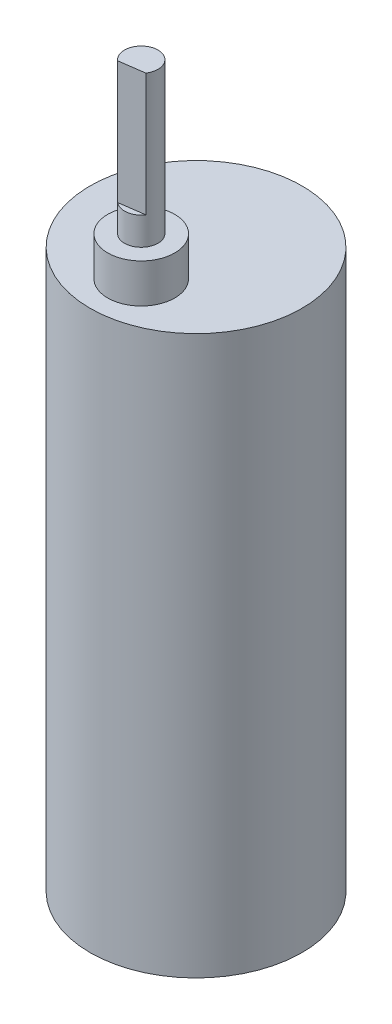
ISO-10303-21;
HEADER;
FILE_DESCRIPTION(('STEP AP214'),'2;1');
FILE_NAME('part.step','',(''),(''),'','','');
FILE_SCHEMA(('AUTOMOTIVE_DESIGN { 1 0 10303 214 1 1 1 1 }'));
ENDSEC;
DATA;
#1=APPLICATION_CONTEXT('core data for automotive mechanical design processes');
#2=APPLICATION_PROTOCOL_DEFINITION('international standard','automotive_design',2000,#1);
#3=PRODUCT_CONTEXT('',#1,'mechanical');
#4=PRODUCT('Part','Part','',(#3));
#5=PRODUCT_RELATED_PRODUCT_CATEGORY('part','',(#4));
#6=PRODUCT_DEFINITION_FORMATION('','',#4);
#7=PRODUCT_DEFINITION_CONTEXT('part definition',#1,'design');
#8=PRODUCT_DEFINITION('design','',#6,#7);
#9=PRODUCT_DEFINITION_SHAPE('','',#8);
#10=(LENGTH_UNIT() NAMED_UNIT(*) SI_UNIT(.MILLI.,.METRE.));
#11=(NAMED_UNIT(*) PLANE_ANGLE_UNIT() SI_UNIT($,.RADIAN.));
#12=(NAMED_UNIT(*) SI_UNIT($,.STERADIAN.) SOLID_ANGLE_UNIT());
#13=UNCERTAINTY_MEASURE_WITH_UNIT(LENGTH_MEASURE(1.E-05),#10,'distance_accuracy_value','');
#14=(GEOMETRIC_REPRESENTATION_CONTEXT(3) GLOBAL_UNCERTAINTY_ASSIGNED_CONTEXT((#13)) GLOBAL_UNIT_ASSIGNED_CONTEXT((#10,
#11,#12)) REPRESENTATION_CONTEXT('',''));
#15=CARTESIAN_POINT('',(0.,0.,0.));
#16=DIRECTION('',(0.,0.,1.));
#17=DIRECTION('',(1.,0.,0.));
#18=AXIS2_PLACEMENT_3D('',#15,#16,#17);
#19=CARTESIAN_POINT('',(0.,100.,0.));
#20=DIRECTION('',(0.,-1.,0.));
#21=DIRECTION('',(0.,0.,-1.));
#22=AXIS2_PLACEMENT_3D('',#19,#20,#21);
#23=CYLINDRICAL_SURFACE('',#22,19.);
#24=CARTESIAN_POINT('',(0.,100.,0.));
#25=DIRECTION('',(0.,1.,0.));
#26=DIRECTION('',(0.,0.,1.));
#27=AXIS2_PLACEMENT_3D('',#24,#25,#26);
#28=CIRCLE('',#27,19.);
#29=CARTESIAN_POINT('',(0.,100.,19.));
#30=VERTEX_POINT('',#29);
#31=EDGE_CURVE('E92',#30,#30,#28,.T.);
#32=ORIENTED_EDGE('',*,*,#31,.F.);
#33=EDGE_LOOP('',(#32));
#34=FACE_BOUND('',#33,.T.);
#35=CARTESIAN_POINT('',(0.,0.,0.));
#36=DIRECTION('',(0.,1.,0.));
#37=DIRECTION('',(0.,0.,1.));
#38=AXIS2_PLACEMENT_3D('',#35,#36,#37);
#39=CIRCLE('',#38,19.);
#40=CARTESIAN_POINT('',(0.,0.,19.));
#41=VERTEX_POINT('',#40);
#42=EDGE_CURVE('E95',#41,#41,#39,.T.);
#43=ORIENTED_EDGE('',*,*,#42,.T.);
#44=EDGE_LOOP('',(#43));
#45=FACE_BOUND('',#44,.T.);
#46=ADVANCED_FACE('F39',(#34,#45),#23,.T.);
#47=CARTESIAN_POINT('',(0.,100.,0.));
#48=DIRECTION('',(0.,1.,0.));
#49=DIRECTION('',(0.,0.,1.));
#50=AXIS2_PLACEMENT_3D('',#47,#48,#49);
#51=PLANE('',#50);
#52=CARTESIAN_POINT('',(0.,100.,9.825));
#53=DIRECTION('',(0.,1.,0.));
#54=DIRECTION('',(0.,0.,1.));
#55=AXIS2_PLACEMENT_3D('',#52,#53,#54);
#56=CIRCLE('',#55,6.);
#57=CARTESIAN_POINT('',(0.,100.,15.825));
#58=VERTEX_POINT('',#57);
#59=EDGE_CURVE('E80',#58,#58,#56,.T.);
#60=ORIENTED_EDGE('',*,*,#59,.F.);
#61=EDGE_LOOP('',(#60));
#62=FACE_BOUND('',#61,.T.);
#63=ORIENTED_EDGE('',*,*,#31,.T.);
#64=EDGE_LOOP('',(#63));
#65=FACE_BOUND('',#64,.T.);
#66=ADVANCED_FACE('F108',(#62,#65),#51,.T.);
#67=CARTESIAN_POINT('',(0.,0.,0.));
#68=DIRECTION('',(0.,1.,0.));
#69=DIRECTION('',(0.,0.,1.));
#70=AXIS2_PLACEMENT_3D('',#67,#68,#69);
#71=PLANE('',#70);
#72=ORIENTED_EDGE('',*,*,#42,.F.);
#73=EDGE_LOOP('',(#72));
#74=FACE_BOUND('',#73,.T.);
#75=ADVANCED_FACE('F105',(#74),#71,.F.);
#76=CARTESIAN_POINT('',(0.,107.,9.825));
#77=DIRECTION('',(0.,-1.,0.));
#78=DIRECTION('',(0.,0.,-1.));
#79=AXIS2_PLACEMENT_3D('',#76,#77,#78);
#80=CYLINDRICAL_SURFACE('',#79,6.);
#81=CARTESIAN_POINT('',(0.,107.,9.825));
#82=DIRECTION('',(0.,1.,0.));
#83=DIRECTION('',(0.,0.,1.));
#84=AXIS2_PLACEMENT_3D('',#81,#82,#83);
#85=CIRCLE('',#84,6.);
#86=CARTESIAN_POINT('',(0.,107.,15.825));
#87=VERTEX_POINT('',#86);
#88=EDGE_CURVE('E85',#87,#87,#85,.T.);
#89=ORIENTED_EDGE('',*,*,#88,.F.);
#90=EDGE_LOOP('',(#89));
#91=FACE_BOUND('',#90,.T.);
#92=ORIENTED_EDGE('',*,*,#59,.T.);
#93=EDGE_LOOP('',(#92));
#94=FACE_BOUND('',#93,.T.);
#95=ADVANCED_FACE('F107',(#91,#94),#80,.T.);
#96=CARTESIAN_POINT('',(0.,107.,9.825));
#97=DIRECTION('',(0.,1.,0.));
#98=DIRECTION('',(0.,0.,1.));
#99=AXIS2_PLACEMENT_3D('',#96,#97,#98);
#100=PLANE('',#99);
#101=CARTESIAN_POINT('',(0.,107.,9.825));
#102=DIRECTION('',(0.,1.,0.));
#103=DIRECTION('',(0.,0.,1.));
#104=AXIS2_PLACEMENT_3D('',#101,#102,#103);
#105=CIRCLE('',#104,3.);
#106=CARTESIAN_POINT('',(0.,107.,12.825));
#107=VERTEX_POINT('',#106);
#108=EDGE_CURVE('E69',#107,#107,#105,.T.);
#109=ORIENTED_EDGE('',*,*,#108,.F.);
#110=EDGE_LOOP('',(#109));
#111=FACE_BOUND('',#110,.T.);
#112=ORIENTED_EDGE('',*,*,#88,.T.);
#113=EDGE_LOOP('',(#112));
#114=FACE_BOUND('',#113,.T.);
#115=ADVANCED_FACE('F113',(#111,#114),#100,.T.);
#116=CARTESIAN_POINT('',(0.,134.,9.825));
#117=DIRECTION('',(0.,-1.,0.));
#118=DIRECTION('',(0.,0.,-1.));
#119=AXIS2_PLACEMENT_3D('',#116,#117,#118);
#120=CYLINDRICAL_SURFACE('',#119,3.);
#121=CARTESIAN_POINT('',(0.,134.,9.825));
#122=DIRECTION('',(0.,1.,0.));
#123=DIRECTION('',(0.,0.,1.));
#124=AXIS2_PLACEMENT_3D('',#121,#122,#123);
#125=CIRCLE('',#124,3.);
#126=CARTESIAN_POINT('',(2.49341293350245,134.,11.4932002107189));
#127=VERTEX_POINT('',#126);
#128=CARTESIAN_POINT('',(-1.93491657983228,134.,12.1176181167151));
#129=VERTEX_POINT('',#128);
#130=EDGE_CURVE('E74',#127,#129,#125,.T.);
#131=ORIENTED_EDGE('',*,*,#130,.F.);
#132=DIRECTION('',(0.,-1.,0.));
#133=VECTOR('',#132,1.);
#134=CARTESIAN_POINT('',(2.49341293350245,134.,11.4932002107189));
#135=LINE('',#134,#133);
#136=CARTESIAN_POINT('',(2.49341293350245,112.,11.4932002107189));
#137=VERTEX_POINT('',#136);
#138=EDGE_CURVE('E54',#127,#137,#135,.T.);
#139=ORIENTED_EDGE('',*,*,#138,.T.);
#140=CARTESIAN_POINT('',(0.,112.,9.825));
#141=DIRECTION('',(0.,1.,0.));
#142=DIRECTION('',(0.,0.,1.));
#143=AXIS2_PLACEMENT_3D('',#140,#141,#142);
#144=CIRCLE('',#143,3.);
#145=CARTESIAN_POINT('',(-1.93491657983228,112.,12.1176181167151));
#146=VERTEX_POINT('',#145);
#147=EDGE_CURVE('E11',#146,#137,#144,.T.);
#148=ORIENTED_EDGE('',*,*,#147,.F.);
#149=DIRECTION('',(0.,-1.,0.));
#150=VECTOR('',#149,1.);
#151=CARTESIAN_POINT('',(-1.93491657983228,134.,12.1176181167151));
#152=LINE('',#151,#150);
#153=EDGE_CURVE('E59',#146,#129,#152,.F.);
#154=ORIENTED_EDGE('',*,*,#153,.T.);
#155=EDGE_LOOP('',(#131,#139,#148,#154));
#156=FACE_BOUND('',#155,.T.);
#157=ORIENTED_EDGE('',*,*,#108,.T.);
#158=EDGE_LOOP('',(#157));
#159=FACE_BOUND('',#158,.T.);
#160=ADVANCED_FACE('F72',(#156,#159),#120,.T.);
#161=CARTESIAN_POINT('',(0.,134.,9.825));
#162=DIRECTION('',(0.,1.,0.));
#163=DIRECTION('',(0.,0.,1.));
#164=AXIS2_PLACEMENT_3D('',#161,#162,#163);
#165=PLANE('',#164);
#166=DIRECTION('',(-0.990204581858502,0.,0.139624088417542));
#167=VECTOR('',#166,1.);
#168=CARTESIAN_POINT('',(0.279248176835084,134.,11.805409163717));
#169=LINE('',#168,#167);
#170=EDGE_CURVE('E47',#127,#129,#169,.T.);
#171=ORIENTED_EDGE('',*,*,#170,.F.);
#172=ORIENTED_EDGE('',*,*,#130,.T.);
#173=EDGE_LOOP('',(#171,#172));
#174=FACE_BOUND('',#173,.T.);
#175=ADVANCED_FACE('F78',(#174),#165,.T.);
#176=CARTESIAN_POINT('',(0.,112.,0.));
#177=DIRECTION('',(0.,1.,0.));
#178=DIRECTION('',(0.,0.,1.));
#179=AXIS2_PLACEMENT_3D('',#176,#177,#178);
#180=PLANE('',#179);
#181=ORIENTED_EDGE('',*,*,#147,.T.);
#182=DIRECTION('',(-0.990204581858502,0.,0.139624088417542));
#183=VECTOR('',#182,1.);
#184=CARTESIAN_POINT('',(-9.15063398495466,112.,13.1350724725391));
#185=LINE('',#184,#183);
#186=EDGE_CURVE('E76',#137,#146,#185,.T.);
#187=ORIENTED_EDGE('',*,*,#186,.T.);
#188=EDGE_LOOP('',(#181,#187));
#189=FACE_BOUND('',#188,.T.);
#190=ADVANCED_FACE('F162',(#189),#180,.T.);
#191=CARTESIAN_POINT('',(-9.15063398495466,112.,13.1350724725391));
#192=DIRECTION('',(-0.139624088417542,0.,-0.990204581858502));
#193=DIRECTION('',(-0.990204581858502,0.,0.139624088417542));
#194=AXIS2_PLACEMENT_3D('',#191,#192,#193);
#195=PLANE('',#194);
#196=ORIENTED_EDGE('',*,*,#170,.T.);
#197=ORIENTED_EDGE('',*,*,#153,.F.);
#198=ORIENTED_EDGE('',*,*,#186,.F.);
#199=ORIENTED_EDGE('',*,*,#138,.F.);
#200=EDGE_LOOP('',(#196,#197,#198,#199));
#201=FACE_BOUND('',#200,.T.);
#202=ADVANCED_FACE('F64',(#201),#195,.F.);
#203=CLOSED_SHELL('',(#46,#66,#75,#95,#115,#160,#175,#190,#202));
#204=MANIFOLD_SOLID_BREP('B2',#203);
#205=ADVANCED_BREP_SHAPE_REPRESENTATION('',(#18,#204),#14);
#206=SHAPE_DEFINITION_REPRESENTATION(#9,#205);
ENDSEC;
END-ISO-10303-21;
